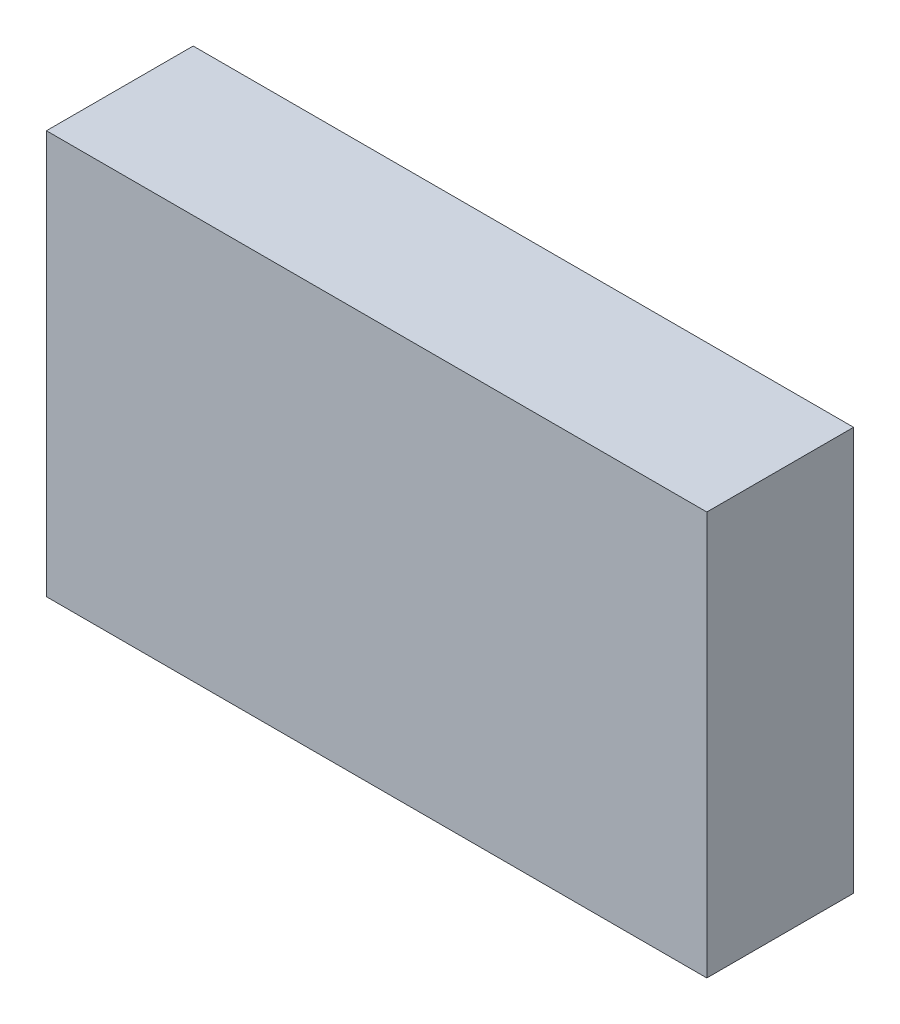
ISO-10303-21;
HEADER;
FILE_DESCRIPTION(('STEP AP214'),'2;1');
FILE_NAME('part.step','',(''),(''),'','','');
FILE_SCHEMA(('AUTOMOTIVE_DESIGN { 1 0 10303 214 1 1 1 1 }'));
ENDSEC;
DATA;
#1=APPLICATION_CONTEXT('core data for automotive mechanical design processes');
#2=APPLICATION_PROTOCOL_DEFINITION('international standard','automotive_design',2000,#1);
#3=PRODUCT_CONTEXT('',#1,'mechanical');
#4=PRODUCT('Part','Part','',(#3));
#5=PRODUCT_RELATED_PRODUCT_CATEGORY('part','',(#4));
#6=PRODUCT_DEFINITION_FORMATION('','',#4);
#7=PRODUCT_DEFINITION_CONTEXT('part definition',#1,'design');
#8=PRODUCT_DEFINITION('design','',#6,#7);
#9=PRODUCT_DEFINITION_SHAPE('','',#8);
#10=(LENGTH_UNIT() NAMED_UNIT(*) SI_UNIT(.MILLI.,.METRE.));
#11=(NAMED_UNIT(*) PLANE_ANGLE_UNIT() SI_UNIT($,.RADIAN.));
#12=(NAMED_UNIT(*) SI_UNIT($,.STERADIAN.) SOLID_ANGLE_UNIT());
#13=UNCERTAINTY_MEASURE_WITH_UNIT(LENGTH_MEASURE(1.E-05),#10,'distance_accuracy_value','');
#14=(GEOMETRIC_REPRESENTATION_CONTEXT(3) GLOBAL_UNCERTAINTY_ASSIGNED_CONTEXT((#13)) GLOBAL_UNIT_ASSIGNED_CONTEXT((#10,
#11,#12)) REPRESENTATION_CONTEXT('',''));
#15=CARTESIAN_POINT('',(0.,0.,0.));
#16=DIRECTION('',(0.,0.,1.));
#17=DIRECTION('',(1.,0.,0.));
#18=AXIS2_PLACEMENT_3D('',#15,#16,#17);
#19=CARTESIAN_POINT('',(0.,0.,20.));
#20=DIRECTION('',(-1.,0.,0.));
#21=DIRECTION('',(0.,0.,1.));
#22=AXIS2_PLACEMENT_3D('',#19,#20,#21);
#23=PLANE('',#22);
#24=DIRECTION('',(0.,1.,0.));
#25=VECTOR('',#24,1.);
#26=CARTESIAN_POINT('',(0.,0.,0.));
#27=LINE('',#26,#25);
#28=CARTESIAN_POINT('',(0.,0.,0.));
#29=VERTEX_POINT('',#28);
#30=CARTESIAN_POINT('',(0.,55.,0.));
#31=VERTEX_POINT('',#30);
#32=EDGE_CURVE('E101',#29,#31,#27,.T.);
#33=ORIENTED_EDGE('',*,*,#32,.T.);
#34=DIRECTION('',(0.,0.,-1.));
#35=VECTOR('',#34,1.);
#36=CARTESIAN_POINT('',(0.,55.,20.));
#37=LINE('',#36,#35);
#38=CARTESIAN_POINT('',(0.,55.,20.));
#39=VERTEX_POINT('',#38);
#40=EDGE_CURVE('E11',#39,#31,#37,.T.);
#41=ORIENTED_EDGE('',*,*,#40,.F.);
#42=DIRECTION('',(0.,1.,0.));
#43=VECTOR('',#42,1.);
#44=CARTESIAN_POINT('',(0.,0.,20.));
#45=LINE('',#44,#43);
#46=CARTESIAN_POINT('',(0.,0.,20.));
#47=VERTEX_POINT('',#46);
#48=EDGE_CURVE('E89',#47,#39,#45,.T.);
#49=ORIENTED_EDGE('',*,*,#48,.F.);
#50=DIRECTION('',(0.,0.,-1.));
#51=VECTOR('',#50,1.);
#52=CARTESIAN_POINT('',(0.,0.,20.));
#53=LINE('',#52,#51);
#54=EDGE_CURVE('E97',#47,#29,#53,.T.);
#55=ORIENTED_EDGE('',*,*,#54,.T.);
#56=EDGE_LOOP('',(#33,#41,#49,#55));
#57=FACE_BOUND('',#56,.T.);
#58=ADVANCED_FACE('F38',(#57),#23,.F.);
#59=CARTESIAN_POINT('',(0.,55.,20.));
#60=DIRECTION('',(0.,-1.,0.));
#61=DIRECTION('',(1.,0.,0.));
#62=AXIS2_PLACEMENT_3D('',#59,#60,#61);
#63=PLANE('',#62);
#64=DIRECTION('',(-1.,0.,0.));
#65=VECTOR('',#64,1.);
#66=CARTESIAN_POINT('',(0.,55.,0.));
#67=LINE('',#66,#65);
#68=CARTESIAN_POINT('',(-90.,55.,0.));
#69=VERTEX_POINT('',#68);
#70=EDGE_CURVE('E93',#31,#69,#67,.T.);
#71=ORIENTED_EDGE('',*,*,#70,.T.);
#72=DIRECTION('',(0.,0.,-1.));
#73=VECTOR('',#72,1.);
#74=CARTESIAN_POINT('',(-90.,55.,20.));
#75=LINE('',#74,#73);
#76=CARTESIAN_POINT('',(-90.,55.,20.));
#77=VERTEX_POINT('',#76);
#78=EDGE_CURVE('E46',#77,#69,#75,.T.);
#79=ORIENTED_EDGE('',*,*,#78,.F.);
#80=DIRECTION('',(-1.,0.,0.));
#81=VECTOR('',#80,1.);
#82=CARTESIAN_POINT('',(0.,55.,20.));
#83=LINE('',#82,#81);
#84=EDGE_CURVE('E84',#39,#77,#83,.T.);
#85=ORIENTED_EDGE('',*,*,#84,.F.);
#86=ORIENTED_EDGE('',*,*,#40,.T.);
#87=EDGE_LOOP('',(#71,#79,#85,#86));
#88=FACE_BOUND('',#87,.T.);
#89=ADVANCED_FACE('F92',(#88),#63,.F.);
#90=CARTESIAN_POINT('',(-90.,0.,20.));
#91=DIRECTION('',(1.,0.,0.));
#92=DIRECTION('',(0.,0.,-1.));
#93=AXIS2_PLACEMENT_3D('',#90,#91,#92);
#94=PLANE('',#93);
#95=DIRECTION('',(0.,-1.,0.));
#96=VECTOR('',#95,1.);
#97=CARTESIAN_POINT('',(-90.,0.,0.));
#98=LINE('',#97,#96);
#99=CARTESIAN_POINT('',(-90.,0.,0.));
#100=VERTEX_POINT('',#99);
#101=EDGE_CURVE('E71',#69,#100,#98,.T.);
#102=ORIENTED_EDGE('',*,*,#101,.T.);
#103=DIRECTION('',(0.,0.,-1.));
#104=VECTOR('',#103,1.);
#105=CARTESIAN_POINT('',(-90.,0.,20.));
#106=LINE('',#105,#104);
#107=CARTESIAN_POINT('',(-90.,0.,20.));
#108=VERTEX_POINT('',#107);
#109=EDGE_CURVE('E94',#108,#100,#106,.T.);
#110=ORIENTED_EDGE('',*,*,#109,.F.);
#111=DIRECTION('',(0.,-1.,0.));
#112=VECTOR('',#111,1.);
#113=CARTESIAN_POINT('',(-90.,0.,20.));
#114=LINE('',#113,#112);
#115=EDGE_CURVE('E87',#77,#108,#114,.T.);
#116=ORIENTED_EDGE('',*,*,#115,.F.);
#117=ORIENTED_EDGE('',*,*,#78,.T.);
#118=EDGE_LOOP('',(#102,#110,#116,#117));
#119=FACE_BOUND('',#118,.T.);
#120=ADVANCED_FACE('F95',(#119),#94,.F.);
#121=CARTESIAN_POINT('',(0.,0.,20.));
#122=DIRECTION('',(0.,1.,0.));
#123=DIRECTION('',(0.,0.,1.));
#124=AXIS2_PLACEMENT_3D('',#121,#122,#123);
#125=PLANE('',#124);
#126=DIRECTION('',(1.,0.,0.));
#127=VECTOR('',#126,1.);
#128=CARTESIAN_POINT('',(0.,0.,0.));
#129=LINE('',#128,#127);
#130=EDGE_CURVE('E77',#100,#29,#129,.T.);
#131=ORIENTED_EDGE('',*,*,#130,.T.);
#132=ORIENTED_EDGE('',*,*,#54,.F.);
#133=DIRECTION('',(1.,0.,0.));
#134=VECTOR('',#133,1.);
#135=CARTESIAN_POINT('',(0.,0.,20.));
#136=LINE('',#135,#134);
#137=EDGE_CURVE('E54',#108,#47,#136,.T.);
#138=ORIENTED_EDGE('',*,*,#137,.F.);
#139=ORIENTED_EDGE('',*,*,#109,.T.);
#140=EDGE_LOOP('',(#131,#132,#138,#139));
#141=FACE_BOUND('',#140,.T.);
#142=ADVANCED_FACE('F108',(#141),#125,.F.);
#143=CARTESIAN_POINT('',(0.,0.,20.));
#144=DIRECTION('',(0.,0.,1.));
#145=DIRECTION('',(1.,0.,0.));
#146=AXIS2_PLACEMENT_3D('',#143,#144,#145);
#147=PLANE('',#146);
#148=ORIENTED_EDGE('',*,*,#48,.T.);
#149=ORIENTED_EDGE('',*,*,#84,.T.);
#150=ORIENTED_EDGE('',*,*,#115,.T.);
#151=ORIENTED_EDGE('',*,*,#137,.T.);
#152=EDGE_LOOP('',(#148,#149,#150,#151));
#153=FACE_BOUND('',#152,.T.);
#154=ADVANCED_FACE('F85',(#153),#147,.T.);
#155=CARTESIAN_POINT('',(0.,0.,0.));
#156=DIRECTION('',(0.,0.,1.));
#157=DIRECTION('',(1.,0.,0.));
#158=AXIS2_PLACEMENT_3D('',#155,#156,#157);
#159=PLANE('',#158);
#160=ORIENTED_EDGE('',*,*,#32,.F.);
#161=ORIENTED_EDGE('',*,*,#130,.F.);
#162=ORIENTED_EDGE('',*,*,#101,.F.);
#163=ORIENTED_EDGE('',*,*,#70,.F.);
#164=EDGE_LOOP('',(#160,#161,#162,#163));
#165=FACE_BOUND('',#164,.T.);
#166=ADVANCED_FACE('F111',(#165),#159,.F.);
#167=CLOSED_SHELL('',(#58,#89,#120,#142,#154,#166));
#168=MANIFOLD_SOLID_BREP('B2',#167);
#169=ADVANCED_BREP_SHAPE_REPRESENTATION('',(#18,#168),#14);
#170=SHAPE_DEFINITION_REPRESENTATION(#9,#169);
ENDSEC;
END-ISO-10303-21;
